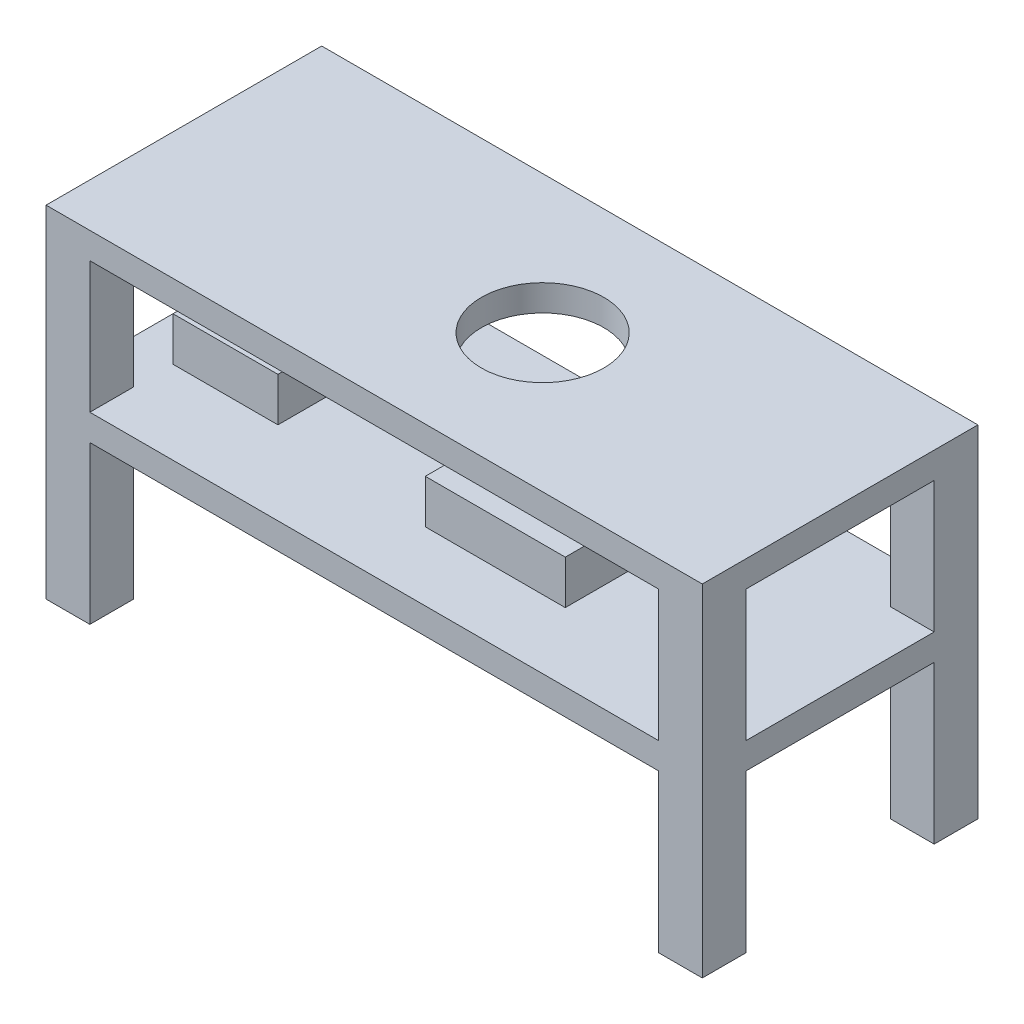
ISO-10303-21;
HEADER;
FILE_DESCRIPTION(('STEP AP214'),'2;1');
FILE_NAME('part.step','',(''),(''),'','','');
FILE_SCHEMA(('AUTOMOTIVE_DESIGN { 1 0 10303 214 1 1 1 1 }'));
ENDSEC;
DATA;
#1=APPLICATION_CONTEXT('core data for automotive mechanical design processes');
#2=APPLICATION_PROTOCOL_DEFINITION('international standard','automotive_design',2000,#1);
#3=PRODUCT_CONTEXT('',#1,'mechanical');
#4=PRODUCT('Part','Part','',(#3));
#5=PRODUCT_RELATED_PRODUCT_CATEGORY('part','',(#4));
#6=PRODUCT_DEFINITION_FORMATION('','',#4);
#7=PRODUCT_DEFINITION_CONTEXT('part definition',#1,'design');
#8=PRODUCT_DEFINITION('design','',#6,#7);
#9=PRODUCT_DEFINITION_SHAPE('','',#8);
#10=(LENGTH_UNIT() NAMED_UNIT(*) SI_UNIT(.MILLI.,.METRE.));
#11=(NAMED_UNIT(*) PLANE_ANGLE_UNIT() SI_UNIT($,.RADIAN.));
#12=(NAMED_UNIT(*) SI_UNIT($,.STERADIAN.) SOLID_ANGLE_UNIT());
#13=UNCERTAINTY_MEASURE_WITH_UNIT(LENGTH_MEASURE(1.E-05),#10,'distance_accuracy_value','');
#14=(GEOMETRIC_REPRESENTATION_CONTEXT(3) GLOBAL_UNCERTAINTY_ASSIGNED_CONTEXT((#13)) GLOBAL_UNIT_ASSIGNED_CONTEXT((#10,
#11,#12)) REPRESENTATION_CONTEXT('',''));
#15=CARTESIAN_POINT('',(0.,0.,0.));
#16=DIRECTION('',(0.,0.,1.));
#17=DIRECTION('',(1.,0.,0.));
#18=AXIS2_PLACEMENT_3D('',#15,#16,#17);
#19=CARTESIAN_POINT('',(0.,-381.,0.));
#20=DIRECTION('',(0.,-1.,0.));
#21=DIRECTION('',(0.,0.,-1.));
#22=AXIS2_PLACEMENT_3D('',#19,#20,#21);
#23=PLANE('',#22);
#24=DIRECTION('',(0.,0.,1.));
#25=VECTOR('',#24,1.);
#26=CARTESIAN_POINT('',(-50.514628547587,-381.,201.224220836117));
#27=LINE('',#26,#25);
#28=CARTESIAN_POINT('',(-50.514628547587,-381.,-205.175779163883));
#29=VERTEX_POINT('',#28);
#30=CARTESIAN_POINT('',(-50.514628547587,-381.,201.224220836117));
#31=VERTEX_POINT('',#30);
#32=EDGE_CURVE('E287',#29,#31,#27,.T.);
#33=ORIENTED_EDGE('',*,*,#32,.F.);
#34=DIRECTION('',(-1.,0.,0.));
#35=VECTOR('',#34,1.);
#36=CARTESIAN_POINT('',(-50.514628547587,-381.,-205.175779163883));
#37=LINE('',#36,#35);
#38=CARTESIAN_POINT('',(355.885371452413,-381.,-205.175779163883));
#39=VERTEX_POINT('',#38);
#40=EDGE_CURVE('E300',#39,#29,#37,.T.);
#41=ORIENTED_EDGE('',*,*,#40,.F.);
#42=DIRECTION('',(0.,0.,-1.));
#43=VECTOR('',#42,1.);
#44=CARTESIAN_POINT('',(355.885371452413,-381.,201.224220836117));
#45=LINE('',#44,#43);
#46=CARTESIAN_POINT('',(355.885371452413,-381.,201.224220836117));
#47=VERTEX_POINT('',#46);
#48=EDGE_CURVE('E309',#47,#39,#45,.T.);
#49=ORIENTED_EDGE('',*,*,#48,.F.);
#50=DIRECTION('',(1.,0.,0.));
#51=VECTOR('',#50,1.);
#52=CARTESIAN_POINT('',(-50.514628547587,-381.,201.224220836117));
#53=LINE('',#52,#51);
#54=EDGE_CURVE('E290',#31,#47,#53,.T.);
#55=ORIENTED_EDGE('',*,*,#54,.F.);
#56=EDGE_LOOP('',(#33,#41,#49,#55));
#57=FACE_BOUND('',#56,.T.);
#58=DIRECTION('',(-1.,0.,0.));
#59=VECTOR('',#58,1.);
#60=CARTESIAN_POINT('',(952.5,-381.,400.05));
#61=LINE('',#60,#59);
#62=CARTESIAN_POINT('',(825.5,-381.,400.05));
#63=VERTEX_POINT('',#62);
#64=CARTESIAN_POINT('',(-825.5,-381.,400.05));
#65=VERTEX_POINT('',#64);
#66=EDGE_CURVE('E443',#63,#65,#61,.T.);
#67=ORIENTED_EDGE('',*,*,#66,.F.);
#68=DIRECTION('',(0.,0.,-1.));
#69=VECTOR('',#68,1.);
#70=CARTESIAN_POINT('',(825.5,-381.,0.));
#71=LINE('',#70,#69);
#72=CARTESIAN_POINT('',(825.5,-381.,273.05));
#73=VERTEX_POINT('',#72);
#74=EDGE_CURVE('E11',#63,#73,#71,.T.);
#75=ORIENTED_EDGE('',*,*,#74,.T.);
#76=DIRECTION('',(1.,0.,0.));
#77=VECTOR('',#76,1.);
#78=CARTESIAN_POINT('',(0.,-381.,273.05));
#79=LINE('',#78,#77);
#80=CARTESIAN_POINT('',(952.5,-381.,273.05));
#81=VERTEX_POINT('',#80);
#82=EDGE_CURVE('E41',#73,#81,#79,.T.);
#83=ORIENTED_EDGE('',*,*,#82,.T.);
#84=DIRECTION('',(0.,0.,1.));
#85=VECTOR('',#84,1.);
#86=CARTESIAN_POINT('',(952.5,-381.,-400.05));
#87=LINE('',#86,#85);
#88=CARTESIAN_POINT('',(952.5,-381.,-273.05));
#89=VERTEX_POINT('',#88);
#90=EDGE_CURVE('E455',#89,#81,#87,.T.);
#91=ORIENTED_EDGE('',*,*,#90,.F.);
#92=DIRECTION('',(-1.,0.,0.));
#93=VECTOR('',#92,1.);
#94=CARTESIAN_POINT('',(0.,-381.,-273.05));
#95=LINE('',#94,#93);
#96=CARTESIAN_POINT('',(825.5,-381.,-273.05));
#97=VERTEX_POINT('',#96);
#98=EDGE_CURVE('E532',#89,#97,#95,.T.);
#99=ORIENTED_EDGE('',*,*,#98,.T.);
#100=DIRECTION('',(0.,0.,-1.));
#101=VECTOR('',#100,1.);
#102=CARTESIAN_POINT('',(825.5,-381.,0.));
#103=LINE('',#102,#101);
#104=CARTESIAN_POINT('',(825.5,-381.,-400.05));
#105=VERTEX_POINT('',#104);
#106=EDGE_CURVE('E529',#97,#105,#103,.T.);
#107=ORIENTED_EDGE('',*,*,#106,.T.);
#108=DIRECTION('',(1.,0.,0.));
#109=VECTOR('',#108,1.);
#110=CARTESIAN_POINT('',(952.5,-381.,-400.05));
#111=LINE('',#110,#109);
#112=CARTESIAN_POINT('',(-825.5,-381.,-400.05));
#113=VERTEX_POINT('',#112);
#114=EDGE_CURVE('E452',#113,#105,#111,.T.);
#115=ORIENTED_EDGE('',*,*,#114,.F.);
#116=DIRECTION('',(0.,0.,1.));
#117=VECTOR('',#116,1.);
#118=CARTESIAN_POINT('',(-825.5,-381.,0.));
#119=LINE('',#118,#117);
#120=CARTESIAN_POINT('',(-825.5,-381.,-273.05));
#121=VERTEX_POINT('',#120);
#122=EDGE_CURVE('E526',#113,#121,#119,.T.);
#123=ORIENTED_EDGE('',*,*,#122,.T.);
#124=DIRECTION('',(-1.,0.,0.));
#125=VECTOR('',#124,1.);
#126=CARTESIAN_POINT('',(0.,-381.,-273.05));
#127=LINE('',#126,#125);
#128=CARTESIAN_POINT('',(-952.5,-381.,-273.05));
#129=VERTEX_POINT('',#128);
#130=EDGE_CURVE('E523',#121,#129,#127,.T.);
#131=ORIENTED_EDGE('',*,*,#130,.T.);
#132=DIRECTION('',(0.,0.,-1.));
#133=VECTOR('',#132,1.);
#134=CARTESIAN_POINT('',(-952.5,-381.,-400.05));
#135=LINE('',#134,#133);
#136=CARTESIAN_POINT('',(-952.5,-381.,273.05));
#137=VERTEX_POINT('',#136);
#138=EDGE_CURVE('E439',#137,#129,#135,.T.);
#139=ORIENTED_EDGE('',*,*,#138,.F.);
#140=DIRECTION('',(-1.,0.,0.));
#141=VECTOR('',#140,1.);
#142=CARTESIAN_POINT('',(-952.5,-381.,273.05));
#143=LINE('',#142,#141);
#144=CARTESIAN_POINT('',(-825.5,-381.,273.05));
#145=VERTEX_POINT('',#144);
#146=EDGE_CURVE('E449',#145,#137,#143,.T.);
#147=ORIENTED_EDGE('',*,*,#146,.F.);
#148=DIRECTION('',(0.,0.,-1.));
#149=VECTOR('',#148,1.);
#150=CARTESIAN_POINT('',(-825.5,-381.,400.05));
#151=LINE('',#150,#149);
#152=EDGE_CURVE('E518',#65,#145,#151,.T.);
#153=ORIENTED_EDGE('',*,*,#152,.F.);
#154=EDGE_LOOP('',(#67,#75,#83,#91,#99,#107,#115,#123,#131,#139,#147,#153));
#155=FACE_BOUND('',#154,.T.);
#156=DIRECTION('',(0.,0.,1.));
#157=VECTOR('',#156,1.);
#158=CARTESIAN_POINT('',(-825.5,-381.,-146.05));
#159=LINE('',#158,#157);
#160=CARTESIAN_POINT('',(-825.5,-381.,-146.05));
#161=VERTEX_POINT('',#160);
#162=CARTESIAN_POINT('',(-825.5,-381.,158.75));
#163=VERTEX_POINT('',#162);
#164=EDGE_CURVE('E286',#161,#163,#159,.T.);
#165=ORIENTED_EDGE('',*,*,#164,.F.);
#166=DIRECTION('',(-1.,0.,0.));
#167=VECTOR('',#166,1.);
#168=CARTESIAN_POINT('',(-825.5,-381.,-146.05));
#169=LINE('',#168,#167);
#170=CARTESIAN_POINT('',(-520.7,-381.,-146.05));
#171=VERTEX_POINT('',#170);
#172=EDGE_CURVE('E283',#171,#161,#169,.T.);
#173=ORIENTED_EDGE('',*,*,#172,.F.);
#174=DIRECTION('',(0.,0.,-1.));
#175=VECTOR('',#174,1.);
#176=CARTESIAN_POINT('',(-520.7,-381.,-146.05));
#177=LINE('',#176,#175);
#178=CARTESIAN_POINT('',(-520.7,-381.,158.75));
#179=VERTEX_POINT('',#178);
#180=EDGE_CURVE('E53',#179,#171,#177,.T.);
#181=ORIENTED_EDGE('',*,*,#180,.F.);
#182=DIRECTION('',(1.,0.,0.));
#183=VECTOR('',#182,1.);
#184=CARTESIAN_POINT('',(-825.5,-381.,158.75));
#185=LINE('',#184,#183);
#186=EDGE_CURVE('E48',#163,#179,#185,.T.);
#187=ORIENTED_EDGE('',*,*,#186,.F.);
#188=EDGE_LOOP('',(#165,#173,#181,#187));
#189=FACE_BOUND('',#188,.T.);
#190=ADVANCED_FACE('F33',(#57,#155,#189),#23,.F.);
#191=CARTESIAN_POINT('',(-952.5,-914.4,273.05));
#192=DIRECTION('',(0.,0.,-1.));
#193=DIRECTION('',(-1.,0.,0.));
#194=AXIS2_PLACEMENT_3D('',#191,#192,#193);
#195=PLANE('',#194);
#196=DIRECTION('',(0.,1.,0.));
#197=VECTOR('',#196,1.);
#198=CARTESIAN_POINT('',(-825.5,-914.4,273.05));
#199=LINE('',#198,#197);
#200=CARTESIAN_POINT('',(-825.5,0.,273.05));
#201=VERTEX_POINT('',#200);
#202=EDGE_CURVE('E484',#145,#201,#199,.T.);
#203=ORIENTED_EDGE('',*,*,#202,.F.);
#204=ORIENTED_EDGE('',*,*,#146,.T.);
#205=DIRECTION('',(0.,1.,0.));
#206=VECTOR('',#205,1.);
#207=CARTESIAN_POINT('',(-952.5,-914.4,273.05));
#208=LINE('',#207,#206);
#209=CARTESIAN_POINT('',(-952.5,0.,273.05));
#210=VERTEX_POINT('',#209);
#211=EDGE_CURVE('E480',#137,#210,#208,.T.);
#212=ORIENTED_EDGE('',*,*,#211,.T.);
#213=DIRECTION('',(-1.,0.,0.));
#214=VECTOR('',#213,1.);
#215=CARTESIAN_POINT('',(0.,0.,273.05));
#216=LINE('',#215,#214);
#217=EDGE_CURVE('E515',#201,#210,#216,.T.);
#218=ORIENTED_EDGE('',*,*,#217,.F.);
#219=EDGE_LOOP('',(#203,#204,#212,#218));
#220=FACE_BOUND('',#219,.T.);
#221=ADVANCED_FACE('F578',(#220),#195,.T.);
#222=CARTESIAN_POINT('',(-825.5,-914.4,400.05));
#223=DIRECTION('',(1.,0.,0.));
#224=DIRECTION('',(0.,0.,-1.));
#225=AXIS2_PLACEMENT_3D('',#222,#223,#224);
#226=PLANE('',#225);
#227=DIRECTION('',(0.,1.,0.));
#228=VECTOR('',#227,1.);
#229=CARTESIAN_POINT('',(-825.5,-914.4,400.05));
#230=LINE('',#229,#228);
#231=CARTESIAN_POINT('',(-825.5,0.,400.05));
#232=VERTEX_POINT('',#231);
#233=EDGE_CURVE('E475',#65,#232,#230,.T.);
#234=ORIENTED_EDGE('',*,*,#233,.F.);
#235=ORIENTED_EDGE('',*,*,#152,.T.);
#236=ORIENTED_EDGE('',*,*,#202,.T.);
#237=DIRECTION('',(0.,0.,-1.));
#238=VECTOR('',#237,1.);
#239=CARTESIAN_POINT('',(-825.5,0.,0.));
#240=LINE('',#239,#238);
#241=EDGE_CURVE('E512',#232,#201,#240,.T.);
#242=ORIENTED_EDGE('',*,*,#241,.F.);
#243=EDGE_LOOP('',(#234,#235,#236,#242));
#244=FACE_BOUND('',#243,.T.);
#245=ADVANCED_FACE('F583',(#244),#226,.T.);
#246=CARTESIAN_POINT('',(-952.5,76.2,400.05));
#247=DIRECTION('',(1.,0.,0.));
#248=DIRECTION('',(0.,0.,-1.));
#249=AXIS2_PLACEMENT_3D('',#246,#247,#248);
#250=PLANE('',#249);
#251=DIRECTION('',(0.,1.,0.));
#252=VECTOR('',#251,1.);
#253=CARTESIAN_POINT('',(-952.5,-914.4,-273.05));
#254=LINE('',#253,#252);
#255=CARTESIAN_POINT('',(-952.5,0.,-273.05));
#256=VERTEX_POINT('',#255);
#257=EDGE_CURVE('E415',#129,#256,#254,.T.);
#258=ORIENTED_EDGE('',*,*,#257,.T.);
#259=DIRECTION('',(0.,0.,1.));
#260=VECTOR('',#259,1.);
#261=CARTESIAN_POINT('',(-952.5,0.,400.05));
#262=LINE('',#261,#260);
#263=EDGE_CURVE('E479',#256,#210,#262,.T.);
#264=ORIENTED_EDGE('',*,*,#263,.T.);
#265=ORIENTED_EDGE('',*,*,#211,.F.);
#266=ORIENTED_EDGE('',*,*,#138,.T.);
#267=EDGE_LOOP('',(#258,#264,#265,#266));
#268=FACE_BOUND('',#267,.T.);
#269=DIRECTION('',(0.,-1.,0.));
#270=VECTOR('',#269,1.);
#271=CARTESIAN_POINT('',(-952.5,76.2,400.05));
#272=LINE('',#271,#270);
#273=CARTESIAN_POINT('',(-952.5,76.2,400.05));
#274=VERTEX_POINT('',#273);
#275=CARTESIAN_POINT('',(-952.5,-914.4,400.05));
#276=VERTEX_POINT('',#275);
#277=EDGE_CURVE('E510',#274,#276,#272,.T.);
#278=ORIENTED_EDGE('',*,*,#277,.F.);
#279=DIRECTION('',(0.,0.,1.));
#280=VECTOR('',#279,1.);
#281=CARTESIAN_POINT('',(-952.5,76.2,400.05));
#282=LINE('',#281,#280);
#283=CARTESIAN_POINT('',(-952.5,76.2,-400.05));
#284=VERTEX_POINT('',#283);
#285=EDGE_CURVE('E488',#284,#274,#282,.T.);
#286=ORIENTED_EDGE('',*,*,#285,.F.);
#287=DIRECTION('',(0.,-1.,0.));
#288=VECTOR('',#287,1.);
#289=CARTESIAN_POINT('',(-952.5,76.2,-400.05));
#290=LINE('',#289,#288);
#291=CARTESIAN_POINT('',(-952.5,-914.4,-400.05));
#292=VERTEX_POINT('',#291);
#293=EDGE_CURVE('E497',#284,#292,#290,.T.);
#294=ORIENTED_EDGE('',*,*,#293,.T.);
#295=DIRECTION('',(0.,0.,1.));
#296=VECTOR('',#295,1.);
#297=CARTESIAN_POINT('',(-952.5,-914.4,-400.05));
#298=LINE('',#297,#296);
#299=CARTESIAN_POINT('',(-952.5,-914.4,-273.05));
#300=VERTEX_POINT('',#299);
#301=EDGE_CURVE('E403',#292,#300,#298,.T.);
#302=ORIENTED_EDGE('',*,*,#301,.T.);
#303=CARTESIAN_POINT('',(-952.5,-457.2,-273.05));
#304=VERTEX_POINT('',#303);
#305=EDGE_CURVE('E425',#300,#304,#254,.T.);
#306=ORIENTED_EDGE('',*,*,#305,.T.);
#307=DIRECTION('',(0.,0.,-1.));
#308=VECTOR('',#307,1.);
#309=CARTESIAN_POINT('',(-952.5,-457.2,-400.05));
#310=LINE('',#309,#308);
#311=CARTESIAN_POINT('',(-952.5,-457.2,273.05));
#312=VERTEX_POINT('',#311);
#313=EDGE_CURVE('E440',#312,#304,#310,.T.);
#314=ORIENTED_EDGE('',*,*,#313,.F.);
#315=CARTESIAN_POINT('',(-952.5,-914.4,273.05));
#316=VERTEX_POINT('',#315);
#317=EDGE_CURVE('E476',#316,#312,#208,.T.);
#318=ORIENTED_EDGE('',*,*,#317,.F.);
#319=DIRECTION('',(0.,0.,1.));
#320=VECTOR('',#319,1.);
#321=CARTESIAN_POINT('',(-952.5,-914.4,400.05));
#322=LINE('',#321,#320);
#323=EDGE_CURVE('E463',#316,#276,#322,.T.);
#324=ORIENTED_EDGE('',*,*,#323,.T.);
#325=EDGE_LOOP('',(#278,#286,#294,#302,#306,#314,#318,#324));
#326=FACE_BOUND('',#325,.T.);
#327=ADVANCED_FACE('F35',(#268,#326),#250,.F.);
#328=CARTESIAN_POINT('',(952.5,76.2,400.05));
#329=DIRECTION('',(0.,0.,-1.));
#330=DIRECTION('',(-1.,0.,0.));
#331=AXIS2_PLACEMENT_3D('',#328,#329,#330);
#332=PLANE('',#331);
#333=DIRECTION('',(0.,1.,0.));
#334=VECTOR('',#333,1.);
#335=CARTESIAN_POINT('',(825.5,-914.4,400.05));
#336=LINE('',#335,#334);
#337=CARTESIAN_POINT('',(825.5,0.,400.05));
#338=VERTEX_POINT('',#337);
#339=EDGE_CURVE('E348',#63,#338,#336,.T.);
#340=ORIENTED_EDGE('',*,*,#339,.F.);
#341=ORIENTED_EDGE('',*,*,#66,.T.);
#342=ORIENTED_EDGE('',*,*,#233,.T.);
#343=DIRECTION('',(1.,0.,0.));
#344=VECTOR('',#343,1.);
#345=CARTESIAN_POINT('',(952.5,0.,400.05));
#346=LINE('',#345,#344);
#347=EDGE_CURVE('E499',#232,#338,#346,.T.);
#348=ORIENTED_EDGE('',*,*,#347,.T.);
#349=EDGE_LOOP('',(#340,#341,#342,#348));
#350=FACE_BOUND('',#349,.T.);
#351=DIRECTION('',(-1.,0.,0.));
#352=VECTOR('',#351,1.);
#353=CARTESIAN_POINT('',(952.5,-457.2,400.05));
#354=LINE('',#353,#352);
#355=CARTESIAN_POINT('',(825.5,-457.2,400.05));
#356=VERTEX_POINT('',#355);
#357=CARTESIAN_POINT('',(-825.5,-457.2,400.05));
#358=VERTEX_POINT('',#357);
#359=EDGE_CURVE('E447',#356,#358,#354,.T.);
#360=ORIENTED_EDGE('',*,*,#359,.F.);
#361=CARTESIAN_POINT('',(825.5,-914.4,400.05));
#362=VERTEX_POINT('',#361);
#363=EDGE_CURVE('E344',#362,#356,#336,.T.);
#364=ORIENTED_EDGE('',*,*,#363,.F.);
#365=DIRECTION('',(1.,0.,0.));
#366=VECTOR('',#365,1.);
#367=CARTESIAN_POINT('',(952.5,-914.4,400.05));
#368=LINE('',#367,#366);
#369=CARTESIAN_POINT('',(952.5,-914.4,400.05));
#370=VERTEX_POINT('',#369);
#371=EDGE_CURVE('E340',#362,#370,#368,.T.);
#372=ORIENTED_EDGE('',*,*,#371,.T.);
#373=DIRECTION('',(0.,-1.,0.));
#374=VECTOR('',#373,1.);
#375=CARTESIAN_POINT('',(952.5,76.2,400.05));
#376=LINE('',#375,#374);
#377=CARTESIAN_POINT('',(952.5,76.2,400.05));
#378=VERTEX_POINT('',#377);
#379=EDGE_CURVE('E508',#378,#370,#376,.T.);
#380=ORIENTED_EDGE('',*,*,#379,.F.);
#381=DIRECTION('',(1.,0.,0.));
#382=VECTOR('',#381,1.);
#383=CARTESIAN_POINT('',(952.5,76.2,400.05));
#384=LINE('',#383,#382);
#385=EDGE_CURVE('E490',#274,#378,#384,.T.);
#386=ORIENTED_EDGE('',*,*,#385,.F.);
#387=ORIENTED_EDGE('',*,*,#277,.T.);
#388=DIRECTION('',(1.,0.,0.));
#389=VECTOR('',#388,1.);
#390=CARTESIAN_POINT('',(-952.5,-914.4,400.05));
#391=LINE('',#390,#389);
#392=CARTESIAN_POINT('',(-825.5,-914.4,400.05));
#393=VERTEX_POINT('',#392);
#394=EDGE_CURVE('E466',#276,#393,#391,.T.);
#395=ORIENTED_EDGE('',*,*,#394,.T.);
#396=EDGE_CURVE('E485',#393,#358,#230,.T.);
#397=ORIENTED_EDGE('',*,*,#396,.T.);
#398=EDGE_LOOP('',(#360,#364,#372,#380,#386,#387,#395,#397));
#399=FACE_BOUND('',#398,.T.);
#400=ADVANCED_FACE('F587',(#350,#399),#332,.F.);
#401=CARTESIAN_POINT('',(952.5,76.2,400.05));
#402=DIRECTION('',(-1.,0.,0.));
#403=DIRECTION('',(0.,0.,1.));
#404=AXIS2_PLACEMENT_3D('',#401,#402,#403);
#405=PLANE('',#404);
#406=DIRECTION('',(0.,1.,0.));
#407=VECTOR('',#406,1.);
#408=CARTESIAN_POINT('',(952.5,-914.4,273.05));
#409=LINE('',#408,#407);
#410=CARTESIAN_POINT('',(952.5,0.,273.05));
#411=VERTEX_POINT('',#410);
#412=EDGE_CURVE('E343',#81,#411,#409,.T.);
#413=ORIENTED_EDGE('',*,*,#412,.T.);
#414=DIRECTION('',(0.,0.,-1.));
#415=VECTOR('',#414,1.);
#416=CARTESIAN_POINT('',(952.5,0.,400.05));
#417=LINE('',#416,#415);
#418=CARTESIAN_POINT('',(952.5,0.,-273.05));
#419=VERTEX_POINT('',#418);
#420=EDGE_CURVE('E502',#411,#419,#417,.T.);
#421=ORIENTED_EDGE('',*,*,#420,.T.);
#422=DIRECTION('',(0.,1.,0.));
#423=VECTOR('',#422,1.);
#424=CARTESIAN_POINT('',(952.5,-914.4,-273.05));
#425=LINE('',#424,#423);
#426=EDGE_CURVE('E384',#89,#419,#425,.T.);
#427=ORIENTED_EDGE('',*,*,#426,.F.);
#428=ORIENTED_EDGE('',*,*,#90,.T.);
#429=EDGE_LOOP('',(#413,#421,#427,#428));
#430=FACE_BOUND('',#429,.T.);
#431=DIRECTION('',(0.,-1.,0.));
#432=VECTOR('',#431,1.);
#433=CARTESIAN_POINT('',(952.5,76.2,-400.05));
#434=LINE('',#433,#432);
#435=CARTESIAN_POINT('',(952.5,76.2,-400.05));
#436=VERTEX_POINT('',#435);
#437=CARTESIAN_POINT('',(952.5,-914.4,-400.05));
#438=VERTEX_POINT('',#437);
#439=EDGE_CURVE('E506',#436,#438,#434,.T.);
#440=ORIENTED_EDGE('',*,*,#439,.F.);
#441=DIRECTION('',(0.,0.,-1.));
#442=VECTOR('',#441,1.);
#443=CARTESIAN_POINT('',(952.5,76.2,400.05));
#444=LINE('',#443,#442);
#445=EDGE_CURVE('E493',#378,#436,#444,.T.);
#446=ORIENTED_EDGE('',*,*,#445,.F.);
#447=ORIENTED_EDGE('',*,*,#379,.T.);
#448=DIRECTION('',(0.,0.,-1.));
#449=VECTOR('',#448,1.);
#450=CARTESIAN_POINT('',(952.5,-914.4,400.05));
#451=LINE('',#450,#449);
#452=CARTESIAN_POINT('',(952.5,-914.4,273.05));
#453=VERTEX_POINT('',#452);
#454=EDGE_CURVE('E329',#370,#453,#451,.T.);
#455=ORIENTED_EDGE('',*,*,#454,.T.);
#456=CARTESIAN_POINT('',(952.5,-457.2,273.05));
#457=VERTEX_POINT('',#456);
#458=EDGE_CURVE('E353',#453,#457,#409,.T.);
#459=ORIENTED_EDGE('',*,*,#458,.T.);
#460=DIRECTION('',(0.,0.,1.));
#461=VECTOR('',#460,1.);
#462=CARTESIAN_POINT('',(952.5,-457.2,-400.05));
#463=LINE('',#462,#461);
#464=CARTESIAN_POINT('',(952.5,-457.2,-273.05));
#465=VERTEX_POINT('',#464);
#466=EDGE_CURVE('E445',#465,#457,#463,.T.);
#467=ORIENTED_EDGE('',*,*,#466,.F.);
#468=CARTESIAN_POINT('',(952.5,-914.4,-273.05));
#469=VERTEX_POINT('',#468);
#470=EDGE_CURVE('E380',#469,#465,#425,.T.);
#471=ORIENTED_EDGE('',*,*,#470,.F.);
#472=DIRECTION('',(0.,0.,-1.));
#473=VECTOR('',#472,1.);
#474=CARTESIAN_POINT('',(952.5,-914.4,-400.05));
#475=LINE('',#474,#473);
#476=EDGE_CURVE('E367',#469,#438,#475,.T.);
#477=ORIENTED_EDGE('',*,*,#476,.T.);
#478=EDGE_LOOP('',(#440,#446,#447,#455,#459,#467,#471,#477));
#479=FACE_BOUND('',#478,.T.);
#480=ADVANCED_FACE('F543',(#430,#479),#405,.F.);
#481=CARTESIAN_POINT('',(952.5,76.2,-400.05));
#482=DIRECTION('',(0.,0.,1.));
#483=DIRECTION('',(1.,0.,0.));
#484=AXIS2_PLACEMENT_3D('',#481,#482,#483);
#485=PLANE('',#484);
#486=DIRECTION('',(0.,1.,0.));
#487=VECTOR('',#486,1.);
#488=CARTESIAN_POINT('',(825.5,-914.4,-400.05));
#489=LINE('',#488,#487);
#490=CARTESIAN_POINT('',(825.5,0.,-400.05));
#491=VERTEX_POINT('',#490);
#492=EDGE_CURVE('E379',#105,#491,#489,.T.);
#493=ORIENTED_EDGE('',*,*,#492,.T.);
#494=DIRECTION('',(-1.,0.,0.));
#495=VECTOR('',#494,1.);
#496=CARTESIAN_POINT('',(952.5,0.,-400.05));
#497=LINE('',#496,#495);
#498=CARTESIAN_POINT('',(-825.5,0.,-400.05));
#499=VERTEX_POINT('',#498);
#500=EDGE_CURVE('E491',#491,#499,#497,.T.);
#501=ORIENTED_EDGE('',*,*,#500,.T.);
#502=DIRECTION('',(0.,1.,0.));
#503=VECTOR('',#502,1.);
#504=CARTESIAN_POINT('',(-825.5,-914.4,-400.05));
#505=LINE('',#504,#503);
#506=EDGE_CURVE('E420',#113,#499,#505,.T.);
#507=ORIENTED_EDGE('',*,*,#506,.F.);
#508=ORIENTED_EDGE('',*,*,#114,.T.);
#509=EDGE_LOOP('',(#493,#501,#507,#508));
#510=FACE_BOUND('',#509,.T.);
#511=ORIENTED_EDGE('',*,*,#293,.F.);
#512=DIRECTION('',(-1.,0.,0.));
#513=VECTOR('',#512,1.);
#514=CARTESIAN_POINT('',(952.5,76.2,-400.05));
#515=LINE('',#514,#513);
#516=EDGE_CURVE('E495',#436,#284,#515,.T.);
#517=ORIENTED_EDGE('',*,*,#516,.F.);
#518=ORIENTED_EDGE('',*,*,#439,.T.);
#519=DIRECTION('',(-1.,0.,0.));
#520=VECTOR('',#519,1.);
#521=CARTESIAN_POINT('',(952.5,-914.4,-400.05));
#522=LINE('',#521,#520);
#523=CARTESIAN_POINT('',(825.5,-914.4,-400.05));
#524=VERTEX_POINT('',#523);
#525=EDGE_CURVE('E370',#438,#524,#522,.T.);
#526=ORIENTED_EDGE('',*,*,#525,.T.);
#527=CARTESIAN_POINT('',(825.5,-457.2,-400.05));
#528=VERTEX_POINT('',#527);
#529=EDGE_CURVE('E389',#524,#528,#489,.T.);
#530=ORIENTED_EDGE('',*,*,#529,.T.);
#531=DIRECTION('',(1.,0.,0.));
#532=VECTOR('',#531,1.);
#533=CARTESIAN_POINT('',(952.5,-457.2,-400.05));
#534=LINE('',#533,#532);
#535=CARTESIAN_POINT('',(-825.5,-457.2,-400.05));
#536=VERTEX_POINT('',#535);
#537=EDGE_CURVE('E442',#536,#528,#534,.T.);
#538=ORIENTED_EDGE('',*,*,#537,.F.);
#539=CARTESIAN_POINT('',(-825.5,-914.4,-400.05));
#540=VERTEX_POINT('',#539);
#541=EDGE_CURVE('E416',#540,#536,#505,.T.);
#542=ORIENTED_EDGE('',*,*,#541,.F.);
#543=DIRECTION('',(-1.,0.,0.));
#544=VECTOR('',#543,1.);
#545=CARTESIAN_POINT('',(-952.5,-914.4,-400.05));
#546=LINE('',#545,#544);
#547=EDGE_CURVE('E412',#540,#292,#546,.T.);
#548=ORIENTED_EDGE('',*,*,#547,.T.);
#549=EDGE_LOOP('',(#511,#517,#518,#526,#530,#538,#542,#548));
#550=FACE_BOUND('',#549,.T.);
#551=ADVANCED_FACE('F560',(#510,#550),#485,.F.);
#552=CARTESIAN_POINT('',(0.,76.2,0.));
#553=DIRECTION('',(0.,1.,0.));
#554=DIRECTION('',(0.,0.,1.));
#555=AXIS2_PLACEMENT_3D('',#552,#553,#554);
#556=PLANE('',#555);
#557=CARTESIAN_POINT('',(88.9000000000002,76.2,0.));
#558=DIRECTION('',(0.,1.,0.));
#559=DIRECTION('',(0.,0.,1.));
#560=AXIS2_PLACEMENT_3D('',#557,#558,#559);
#561=CIRCLE('',#560,177.8);
#562=CARTESIAN_POINT('',(88.9000000000002,76.2,177.8));
#563=VERTEX_POINT('',#562);
#564=EDGE_CURVE('E325',#563,#563,#561,.T.);
#565=ORIENTED_EDGE('',*,*,#564,.F.);
#566=EDGE_LOOP('',(#565));
#567=FACE_BOUND('',#566,.T.);
#568=ORIENTED_EDGE('',*,*,#385,.T.);
#569=ORIENTED_EDGE('',*,*,#445,.T.);
#570=ORIENTED_EDGE('',*,*,#516,.T.);
#571=ORIENTED_EDGE('',*,*,#285,.T.);
#572=EDGE_LOOP('',(#568,#569,#570,#571));
#573=FACE_BOUND('',#572,.T.);
#574=ADVANCED_FACE('F631',(#567,#573),#556,.T.);
#575=CARTESIAN_POINT('',(0.,0.,0.));
#576=DIRECTION('',(0.,1.,0.));
#577=DIRECTION('',(0.,0.,1.));
#578=AXIS2_PLACEMENT_3D('',#575,#576,#577);
#579=PLANE('',#578);
#580=CARTESIAN_POINT('',(88.9000000000002,0.,0.));
#581=DIRECTION('',(0.,1.,0.));
#582=DIRECTION('',(0.,0.,1.));
#583=AXIS2_PLACEMENT_3D('',#580,#581,#582);
#584=CIRCLE('',#583,177.8);
#585=CARTESIAN_POINT('',(88.9000000000002,0.,177.8));
#586=VERTEX_POINT('',#585);
#587=EDGE_CURVE('E326',#586,#586,#584,.T.);
#588=ORIENTED_EDGE('',*,*,#587,.T.);
#589=EDGE_LOOP('',(#588));
#590=FACE_BOUND('',#589,.T.);
#591=DIRECTION('',(-1.,0.,0.));
#592=VECTOR('',#591,1.);
#593=CARTESIAN_POINT('',(0.,0.,273.05));
#594=LINE('',#593,#592);
#595=CARTESIAN_POINT('',(825.5,0.,273.05));
#596=VERTEX_POINT('',#595);
#597=EDGE_CURVE('E358',#411,#596,#594,.T.);
#598=ORIENTED_EDGE('',*,*,#597,.T.);
#599=DIRECTION('',(0.,0.,1.));
#600=VECTOR('',#599,1.);
#601=CARTESIAN_POINT('',(825.5,0.,0.));
#602=LINE('',#601,#600);
#603=EDGE_CURVE('E364',#596,#338,#602,.T.);
#604=ORIENTED_EDGE('',*,*,#603,.T.);
#605=ORIENTED_EDGE('',*,*,#347,.F.);
#606=ORIENTED_EDGE('',*,*,#241,.T.);
#607=ORIENTED_EDGE('',*,*,#217,.T.);
#608=ORIENTED_EDGE('',*,*,#263,.F.);
#609=DIRECTION('',(1.,0.,0.));
#610=VECTOR('',#609,1.);
#611=CARTESIAN_POINT('',(0.,0.,-273.05));
#612=LINE('',#611,#610);
#613=CARTESIAN_POINT('',(-825.5,0.,-273.05));
#614=VERTEX_POINT('',#613);
#615=EDGE_CURVE('E430',#256,#614,#612,.T.);
#616=ORIENTED_EDGE('',*,*,#615,.T.);
#617=DIRECTION('',(0.,0.,-1.));
#618=VECTOR('',#617,1.);
#619=CARTESIAN_POINT('',(-825.5,0.,0.));
#620=LINE('',#619,#618);
#621=EDGE_CURVE('E436',#614,#499,#620,.T.);
#622=ORIENTED_EDGE('',*,*,#621,.T.);
#623=ORIENTED_EDGE('',*,*,#500,.F.);
#624=DIRECTION('',(0.,0.,1.));
#625=VECTOR('',#624,1.);
#626=CARTESIAN_POINT('',(825.5,0.,0.));
#627=LINE('',#626,#625);
#628=CARTESIAN_POINT('',(825.5,0.,-273.05));
#629=VERTEX_POINT('',#628);
#630=EDGE_CURVE('E394',#491,#629,#627,.T.);
#631=ORIENTED_EDGE('',*,*,#630,.T.);
#632=DIRECTION('',(1.,0.,0.));
#633=VECTOR('',#632,1.);
#634=CARTESIAN_POINT('',(0.,0.,-273.05));
#635=LINE('',#634,#633);
#636=EDGE_CURVE('E400',#629,#419,#635,.T.);
#637=ORIENTED_EDGE('',*,*,#636,.T.);
#638=ORIENTED_EDGE('',*,*,#420,.F.);
#639=EDGE_LOOP('',(#598,#604,#605,#606,#607,#608,#616,#622,#623,#631,#637,#638));
#640=FACE_BOUND('',#639,.T.);
#641=ADVANCED_FACE('F552',(#590,#640),#579,.F.);
#642=DIRECTION('',(-1.,0.,0.));
#643=VECTOR('',#642,1.);
#644=CARTESIAN_POINT('',(-952.5,-457.2,273.05));
#645=LINE('',#644,#643);
#646=CARTESIAN_POINT('',(-825.5,-457.2,273.05));
#647=VERTEX_POINT('',#646);
#648=EDGE_CURVE('E461',#647,#312,#645,.T.);
#649=ORIENTED_EDGE('',*,*,#648,.F.);
#650=CARTESIAN_POINT('',(-825.5,-914.4,273.05));
#651=VERTEX_POINT('',#650);
#652=EDGE_CURVE('E481',#651,#647,#199,.T.);
#653=ORIENTED_EDGE('',*,*,#652,.F.);
#654=DIRECTION('',(-1.,0.,0.));
#655=VECTOR('',#654,1.);
#656=CARTESIAN_POINT('',(-952.5,-914.4,273.05));
#657=LINE('',#656,#655);
#658=EDGE_CURVE('E472',#651,#316,#657,.T.);
#659=ORIENTED_EDGE('',*,*,#658,.T.);
#660=ORIENTED_EDGE('',*,*,#317,.T.);
#661=EDGE_LOOP('',(#649,#653,#659,#660));
#662=FACE_BOUND('',#661,.T.);
#663=ADVANCED_FACE('F616',(#662),#195,.T.);
#664=DIRECTION('',(0.,0.,-1.));
#665=VECTOR('',#664,1.);
#666=CARTESIAN_POINT('',(-825.5,-457.2,400.05));
#667=LINE('',#666,#665);
#668=EDGE_CURVE('E521',#358,#647,#667,.T.);
#669=ORIENTED_EDGE('',*,*,#668,.F.);
#670=ORIENTED_EDGE('',*,*,#396,.F.);
#671=DIRECTION('',(0.,0.,-1.));
#672=VECTOR('',#671,1.);
#673=CARTESIAN_POINT('',(-825.5,-914.4,400.05));
#674=LINE('',#673,#672);
#675=EDGE_CURVE('E469',#393,#651,#674,.T.);
#676=ORIENTED_EDGE('',*,*,#675,.T.);
#677=ORIENTED_EDGE('',*,*,#652,.T.);
#678=EDGE_LOOP('',(#669,#670,#676,#677));
#679=FACE_BOUND('',#678,.T.);
#680=ADVANCED_FACE('F623',(#679),#226,.T.);
#681=CARTESIAN_POINT('',(0.,-914.4,0.));
#682=DIRECTION('',(0.,-1.,0.));
#683=DIRECTION('',(0.,0.,-1.));
#684=AXIS2_PLACEMENT_3D('',#681,#682,#683);
#685=PLANE('',#684);
#686=ORIENTED_EDGE('',*,*,#323,.F.);
#687=ORIENTED_EDGE('',*,*,#658,.F.);
#688=ORIENTED_EDGE('',*,*,#675,.F.);
#689=ORIENTED_EDGE('',*,*,#394,.F.);
#690=EDGE_LOOP('',(#686,#687,#688,#689));
#691=FACE_BOUND('',#690,.T.);
#692=ADVANCED_FACE('F621',(#691),#685,.T.);
#693=CARTESIAN_POINT('',(0.,-457.2,0.));
#694=DIRECTION('',(0.,-1.,0.));
#695=DIRECTION('',(0.,0.,-1.));
#696=AXIS2_PLACEMENT_3D('',#693,#694,#695);
#697=PLANE('',#696);
#698=DIRECTION('',(0.,0.,-1.));
#699=VECTOR('',#698,1.);
#700=CARTESIAN_POINT('',(825.5,-457.2,0.));
#701=LINE('',#700,#699);
#702=CARTESIAN_POINT('',(825.5,-457.2,273.05));
#703=VERTEX_POINT('',#702);
#704=EDGE_CURVE('E361',#356,#703,#701,.T.);
#705=ORIENTED_EDGE('',*,*,#704,.F.);
#706=ORIENTED_EDGE('',*,*,#359,.T.);
#707=ORIENTED_EDGE('',*,*,#668,.T.);
#708=ORIENTED_EDGE('',*,*,#648,.T.);
#709=ORIENTED_EDGE('',*,*,#313,.T.);
#710=DIRECTION('',(-1.,0.,0.));
#711=VECTOR('',#710,1.);
#712=CARTESIAN_POINT('',(0.,-457.2,-273.05));
#713=LINE('',#712,#711);
#714=CARTESIAN_POINT('',(-825.5,-457.2,-273.05));
#715=VERTEX_POINT('',#714);
#716=EDGE_CURVE('E419',#715,#304,#713,.T.);
#717=ORIENTED_EDGE('',*,*,#716,.F.);
#718=DIRECTION('',(0.,0.,1.));
#719=VECTOR('',#718,1.);
#720=CARTESIAN_POINT('',(-825.5,-457.2,0.));
#721=LINE('',#720,#719);
#722=EDGE_CURVE('E433',#536,#715,#721,.T.);
#723=ORIENTED_EDGE('',*,*,#722,.F.);
#724=ORIENTED_EDGE('',*,*,#537,.T.);
#725=DIRECTION('',(0.,0.,-1.));
#726=VECTOR('',#725,1.);
#727=CARTESIAN_POINT('',(825.5,-457.2,0.));
#728=LINE('',#727,#726);
#729=CARTESIAN_POINT('',(825.5,-457.2,-273.05));
#730=VERTEX_POINT('',#729);
#731=EDGE_CURVE('E383',#730,#528,#728,.T.);
#732=ORIENTED_EDGE('',*,*,#731,.F.);
#733=DIRECTION('',(-1.,0.,0.));
#734=VECTOR('',#733,1.);
#735=CARTESIAN_POINT('',(0.,-457.2,-273.05));
#736=LINE('',#735,#734);
#737=EDGE_CURVE('E397',#465,#730,#736,.T.);
#738=ORIENTED_EDGE('',*,*,#737,.F.);
#739=ORIENTED_EDGE('',*,*,#466,.T.);
#740=DIRECTION('',(1.,0.,0.));
#741=VECTOR('',#740,1.);
#742=CARTESIAN_POINT('',(0.,-457.2,273.05));
#743=LINE('',#742,#741);
#744=EDGE_CURVE('E347',#703,#457,#743,.T.);
#745=ORIENTED_EDGE('',*,*,#744,.F.);
#746=EDGE_LOOP('',(#705,#706,#707,#708,#709,#717,#723,#724,#732,#738,#739,#745));
#747=FACE_BOUND('',#746,.T.);
#748=ADVANCED_FACE('F619',(#747),#697,.T.);
#749=CARTESIAN_POINT('',(-952.5,-914.4,-273.05));
#750=DIRECTION('',(0.,0.,1.));
#751=DIRECTION('',(1.,0.,0.));
#752=AXIS2_PLACEMENT_3D('',#749,#750,#751);
#753=PLANE('',#752);
#754=ORIENTED_EDGE('',*,*,#615,.F.);
#755=ORIENTED_EDGE('',*,*,#257,.F.);
#756=ORIENTED_EDGE('',*,*,#130,.F.);
#757=DIRECTION('',(0.,1.,0.));
#758=VECTOR('',#757,1.);
#759=CARTESIAN_POINT('',(-825.5,-914.4,-273.05));
#760=LINE('',#759,#758);
#761=EDGE_CURVE('E424',#121,#614,#760,.T.);
#762=ORIENTED_EDGE('',*,*,#761,.T.);
#763=EDGE_LOOP('',(#754,#755,#756,#762));
#764=FACE_BOUND('',#763,.T.);
#765=ADVANCED_FACE('F570',(#764),#753,.T.);
#766=CARTESIAN_POINT('',(-825.5,-914.4,-400.05));
#767=DIRECTION('',(1.,0.,0.));
#768=DIRECTION('',(0.,0.,-1.));
#769=AXIS2_PLACEMENT_3D('',#766,#767,#768);
#770=PLANE('',#769);
#771=ORIENTED_EDGE('',*,*,#621,.F.);
#772=ORIENTED_EDGE('',*,*,#761,.F.);
#773=ORIENTED_EDGE('',*,*,#122,.F.);
#774=ORIENTED_EDGE('',*,*,#506,.T.);
#775=EDGE_LOOP('',(#771,#772,#773,#774));
#776=FACE_BOUND('',#775,.T.);
#777=ADVANCED_FACE('F565',(#776),#770,.T.);
#778=ORIENTED_EDGE('',*,*,#541,.T.);
#779=ORIENTED_EDGE('',*,*,#722,.T.);
#780=CARTESIAN_POINT('',(-825.5,-914.4,-273.05));
#781=VERTEX_POINT('',#780);
#782=EDGE_CURVE('E421',#781,#715,#760,.T.);
#783=ORIENTED_EDGE('',*,*,#782,.F.);
#784=DIRECTION('',(0.,0.,-1.));
#785=VECTOR('',#784,1.);
#786=CARTESIAN_POINT('',(-825.5,-914.4,-400.05));
#787=LINE('',#786,#785);
#788=EDGE_CURVE('E409',#781,#540,#787,.T.);
#789=ORIENTED_EDGE('',*,*,#788,.T.);
#790=EDGE_LOOP('',(#778,#779,#783,#789));
#791=FACE_BOUND('',#790,.T.);
#792=ADVANCED_FACE('F736',(#791),#770,.T.);
#793=ORIENTED_EDGE('',*,*,#782,.T.);
#794=ORIENTED_EDGE('',*,*,#716,.T.);
#795=ORIENTED_EDGE('',*,*,#305,.F.);
#796=DIRECTION('',(1.,0.,0.));
#797=VECTOR('',#796,1.);
#798=CARTESIAN_POINT('',(-952.5,-914.4,-273.05));
#799=LINE('',#798,#797);
#800=EDGE_CURVE('E406',#300,#781,#799,.T.);
#801=ORIENTED_EDGE('',*,*,#800,.T.);
#802=EDGE_LOOP('',(#793,#794,#795,#801));
#803=FACE_BOUND('',#802,.T.);
#804=ADVANCED_FACE('F729',(#803),#753,.T.);
#805=CARTESIAN_POINT('',(0.,-914.4,0.));
#806=DIRECTION('',(0.,1.,0.));
#807=DIRECTION('',(0.,0.,1.));
#808=AXIS2_PLACEMENT_3D('',#805,#806,#807);
#809=PLANE('',#808);
#810=ORIENTED_EDGE('',*,*,#301,.F.);
#811=ORIENTED_EDGE('',*,*,#547,.F.);
#812=ORIENTED_EDGE('',*,*,#788,.F.);
#813=ORIENTED_EDGE('',*,*,#800,.F.);
#814=EDGE_LOOP('',(#810,#811,#812,#813));
#815=FACE_BOUND('',#814,.T.);
#816=ADVANCED_FACE('F751',(#815),#809,.F.);
#817=CARTESIAN_POINT('',(825.5,-914.4,-400.05));
#818=DIRECTION('',(-1.,0.,0.));
#819=DIRECTION('',(0.,0.,1.));
#820=AXIS2_PLACEMENT_3D('',#817,#818,#819);
#821=PLANE('',#820);
#822=ORIENTED_EDGE('',*,*,#630,.F.);
#823=ORIENTED_EDGE('',*,*,#492,.F.);
#824=ORIENTED_EDGE('',*,*,#106,.F.);
#825=DIRECTION('',(0.,1.,0.));
#826=VECTOR('',#825,1.);
#827=CARTESIAN_POINT('',(825.5,-914.4,-273.05));
#828=LINE('',#827,#826);
#829=EDGE_CURVE('E388',#97,#629,#828,.T.);
#830=ORIENTED_EDGE('',*,*,#829,.T.);
#831=EDGE_LOOP('',(#822,#823,#824,#830));
#832=FACE_BOUND('',#831,.T.);
#833=ADVANCED_FACE('F556',(#832),#821,.T.);
#834=CARTESIAN_POINT('',(952.5,-914.4,-273.05));
#835=DIRECTION('',(0.,0.,1.));
#836=DIRECTION('',(1.,0.,0.));
#837=AXIS2_PLACEMENT_3D('',#834,#835,#836);
#838=PLANE('',#837);
#839=ORIENTED_EDGE('',*,*,#636,.F.);
#840=ORIENTED_EDGE('',*,*,#829,.F.);
#841=ORIENTED_EDGE('',*,*,#98,.F.);
#842=ORIENTED_EDGE('',*,*,#426,.T.);
#843=EDGE_LOOP('',(#839,#840,#841,#842));
#844=FACE_BOUND('',#843,.T.);
#845=ADVANCED_FACE('F548',(#844),#838,.T.);
#846=ORIENTED_EDGE('',*,*,#470,.T.);
#847=ORIENTED_EDGE('',*,*,#737,.T.);
#848=CARTESIAN_POINT('',(825.5,-914.4,-273.05));
#849=VERTEX_POINT('',#848);
#850=EDGE_CURVE('E385',#849,#730,#828,.T.);
#851=ORIENTED_EDGE('',*,*,#850,.F.);
#852=DIRECTION('',(1.,0.,0.));
#853=VECTOR('',#852,1.);
#854=CARTESIAN_POINT('',(952.5,-914.4,-273.05));
#855=LINE('',#854,#853);
#856=EDGE_CURVE('E376',#849,#469,#855,.T.);
#857=ORIENTED_EDGE('',*,*,#856,.T.);
#858=EDGE_LOOP('',(#846,#847,#851,#857));
#859=FACE_BOUND('',#858,.T.);
#860=ADVANCED_FACE('F774',(#859),#838,.T.);
#861=ORIENTED_EDGE('',*,*,#850,.T.);
#862=ORIENTED_EDGE('',*,*,#731,.T.);
#863=ORIENTED_EDGE('',*,*,#529,.F.);
#864=DIRECTION('',(0.,0.,1.));
#865=VECTOR('',#864,1.);
#866=CARTESIAN_POINT('',(825.5,-914.4,-400.05));
#867=LINE('',#866,#865);
#868=EDGE_CURVE('E373',#524,#849,#867,.T.);
#869=ORIENTED_EDGE('',*,*,#868,.T.);
#870=EDGE_LOOP('',(#861,#862,#863,#869));
#871=FACE_BOUND('',#870,.T.);
#872=ADVANCED_FACE('F603',(#871),#821,.T.);
#873=CARTESIAN_POINT('',(0.,-914.4,0.));
#874=DIRECTION('',(0.,-1.,0.));
#875=DIRECTION('',(0.,0.,-1.));
#876=AXIS2_PLACEMENT_3D('',#873,#874,#875);
#877=PLANE('',#876);
#878=ORIENTED_EDGE('',*,*,#476,.F.);
#879=ORIENTED_EDGE('',*,*,#856,.F.);
#880=ORIENTED_EDGE('',*,*,#868,.F.);
#881=ORIENTED_EDGE('',*,*,#525,.F.);
#882=EDGE_LOOP('',(#878,#879,#880,#881));
#883=FACE_BOUND('',#882,.T.);
#884=ADVANCED_FACE('F594',(#883),#877,.T.);
#885=CARTESIAN_POINT('',(952.5,-914.4,273.05));
#886=DIRECTION('',(0.,0.,-1.));
#887=DIRECTION('',(-1.,0.,0.));
#888=AXIS2_PLACEMENT_3D('',#885,#886,#887);
#889=PLANE('',#888);
#890=ORIENTED_EDGE('',*,*,#597,.F.);
#891=ORIENTED_EDGE('',*,*,#412,.F.);
#892=ORIENTED_EDGE('',*,*,#82,.F.);
#893=DIRECTION('',(0.,1.,0.));
#894=VECTOR('',#893,1.);
#895=CARTESIAN_POINT('',(825.5,-914.4,273.05));
#896=LINE('',#895,#894);
#897=EDGE_CURVE('E352',#73,#596,#896,.T.);
#898=ORIENTED_EDGE('',*,*,#897,.T.);
#899=EDGE_LOOP('',(#890,#891,#892,#898));
#900=FACE_BOUND('',#899,.T.);
#901=ADVANCED_FACE('F592',(#900),#889,.T.);
#902=CARTESIAN_POINT('',(825.5,-914.4,400.05));
#903=DIRECTION('',(-1.,0.,0.));
#904=DIRECTION('',(0.,0.,1.));
#905=AXIS2_PLACEMENT_3D('',#902,#903,#904);
#906=PLANE('',#905);
#907=ORIENTED_EDGE('',*,*,#603,.F.);
#908=ORIENTED_EDGE('',*,*,#897,.F.);
#909=ORIENTED_EDGE('',*,*,#74,.F.);
#910=ORIENTED_EDGE('',*,*,#339,.T.);
#911=EDGE_LOOP('',(#907,#908,#909,#910));
#912=FACE_BOUND('',#911,.T.);
#913=ADVANCED_FACE('F591',(#912),#906,.T.);
#914=ORIENTED_EDGE('',*,*,#363,.T.);
#915=ORIENTED_EDGE('',*,*,#704,.T.);
#916=CARTESIAN_POINT('',(825.5,-914.4,273.05));
#917=VERTEX_POINT('',#916);
#918=EDGE_CURVE('E349',#917,#703,#896,.T.);
#919=ORIENTED_EDGE('',*,*,#918,.F.);
#920=DIRECTION('',(0.,0.,1.));
#921=VECTOR('',#920,1.);
#922=CARTESIAN_POINT('',(825.5,-914.4,400.05));
#923=LINE('',#922,#921);
#924=EDGE_CURVE('E337',#917,#362,#923,.T.);
#925=ORIENTED_EDGE('',*,*,#924,.T.);
#926=EDGE_LOOP('',(#914,#915,#919,#925));
#927=FACE_BOUND('',#926,.T.);
#928=ADVANCED_FACE('F601',(#927),#906,.T.);
#929=ORIENTED_EDGE('',*,*,#918,.T.);
#930=ORIENTED_EDGE('',*,*,#744,.T.);
#931=ORIENTED_EDGE('',*,*,#458,.F.);
#932=DIRECTION('',(-1.,0.,0.));
#933=VECTOR('',#932,1.);
#934=CARTESIAN_POINT('',(952.5,-914.4,273.05));
#935=LINE('',#934,#933);
#936=EDGE_CURVE('E334',#453,#917,#935,.T.);
#937=ORIENTED_EDGE('',*,*,#936,.T.);
#938=EDGE_LOOP('',(#929,#930,#931,#937));
#939=FACE_BOUND('',#938,.T.);
#940=ADVANCED_FACE('F596',(#939),#889,.T.);
#941=CARTESIAN_POINT('',(0.,-914.4,0.));
#942=DIRECTION('',(0.,1.,0.));
#943=DIRECTION('',(0.,0.,1.));
#944=AXIS2_PLACEMENT_3D('',#941,#942,#943);
#945=PLANE('',#944);
#946=ORIENTED_EDGE('',*,*,#454,.F.);
#947=ORIENTED_EDGE('',*,*,#371,.F.);
#948=ORIENTED_EDGE('',*,*,#924,.F.);
#949=ORIENTED_EDGE('',*,*,#936,.F.);
#950=EDGE_LOOP('',(#946,#947,#948,#949));
#951=FACE_BOUND('',#950,.T.);
#952=ADVANCED_FACE('F607',(#951),#945,.F.);
#953=CARTESIAN_POINT('',(88.9000000000002,0.,0.));
#954=DIRECTION('',(0.,1.,0.));
#955=DIRECTION('',(0.,0.,1.));
#956=AXIS2_PLACEMENT_3D('',#953,#954,#955);
#957=CYLINDRICAL_SURFACE('',#956,177.8);
#958=ORIENTED_EDGE('',*,*,#587,.F.);
#959=EDGE_LOOP('',(#958));
#960=FACE_BOUND('',#959,.T.);
#961=ORIENTED_EDGE('',*,*,#564,.T.);
#962=EDGE_LOOP('',(#961));
#963=FACE_BOUND('',#962,.T.);
#964=ADVANCED_FACE('F822',(#960,#963),#957,.F.);
#965=CARTESIAN_POINT('',(-50.514628547587,-254.,201.224220836117));
#966=DIRECTION('',(1.,0.,0.));
#967=DIRECTION('',(0.,0.,-1.));
#968=AXIS2_PLACEMENT_3D('',#965,#966,#967);
#969=PLANE('',#968);
#970=ORIENTED_EDGE('',*,*,#32,.T.);
#971=DIRECTION('',(0.,-1.,0.));
#972=VECTOR('',#971,1.);
#973=CARTESIAN_POINT('',(-50.514628547587,-254.,201.224220836117));
#974=LINE('',#973,#972);
#975=CARTESIAN_POINT('',(-50.514628547587,-254.,201.224220836117));
#976=VERTEX_POINT('',#975);
#977=EDGE_CURVE('E322',#976,#31,#974,.T.);
#978=ORIENTED_EDGE('',*,*,#977,.F.);
#979=DIRECTION('',(0.,0.,1.));
#980=VECTOR('',#979,1.);
#981=CARTESIAN_POINT('',(-50.514628547587,-254.,201.224220836117));
#982=LINE('',#981,#980);
#983=CARTESIAN_POINT('',(-50.514628547587,-254.,-205.175779163883));
#984=VERTEX_POINT('',#983);
#985=EDGE_CURVE('E296',#984,#976,#982,.T.);
#986=ORIENTED_EDGE('',*,*,#985,.F.);
#987=DIRECTION('',(0.,-1.,0.));
#988=VECTOR('',#987,1.);
#989=CARTESIAN_POINT('',(-50.514628547587,-254.,-205.175779163883));
#990=LINE('',#989,#988);
#991=EDGE_CURVE('E305',#984,#29,#990,.T.);
#992=ORIENTED_EDGE('',*,*,#991,.T.);
#993=EDGE_LOOP('',(#970,#978,#986,#992));
#994=FACE_BOUND('',#993,.T.);
#995=ADVANCED_FACE('F832',(#994),#969,.F.);
#996=CARTESIAN_POINT('',(-50.514628547587,-254.,201.224220836117));
#997=DIRECTION('',(0.,0.,-1.));
#998=DIRECTION('',(-1.,0.,0.));
#999=AXIS2_PLACEMENT_3D('',#996,#997,#998);
#1000=PLANE('',#999);
#1001=ORIENTED_EDGE('',*,*,#54,.T.);
#1002=DIRECTION('',(0.,-1.,0.));
#1003=VECTOR('',#1002,1.);
#1004=CARTESIAN_POINT('',(355.885371452413,-254.,201.224220836117));
#1005=LINE('',#1004,#1003);
#1006=CARTESIAN_POINT('',(355.885371452413,-254.,201.224220836117));
#1007=VERTEX_POINT('',#1006);
#1008=EDGE_CURVE('E319',#1007,#47,#1005,.T.);
#1009=ORIENTED_EDGE('',*,*,#1008,.F.);
#1010=DIRECTION('',(1.,0.,0.));
#1011=VECTOR('',#1010,1.);
#1012=CARTESIAN_POINT('',(-50.514628547587,-254.,201.224220836117));
#1013=LINE('',#1012,#1011);
#1014=EDGE_CURVE('E299',#976,#1007,#1013,.T.);
#1015=ORIENTED_EDGE('',*,*,#1014,.F.);
#1016=ORIENTED_EDGE('',*,*,#977,.T.);
#1017=EDGE_LOOP('',(#1001,#1009,#1015,#1016));
#1018=FACE_BOUND('',#1017,.T.);
#1019=ADVANCED_FACE('F842',(#1018),#1000,.F.);
#1020=CARTESIAN_POINT('',(355.885371452413,-254.,201.224220836117));
#1021=DIRECTION('',(-1.,0.,0.));
#1022=DIRECTION('',(0.,0.,1.));
#1023=AXIS2_PLACEMENT_3D('',#1020,#1021,#1022);
#1024=PLANE('',#1023);
#1025=ORIENTED_EDGE('',*,*,#48,.T.);
#1026=DIRECTION('',(0.,-1.,0.));
#1027=VECTOR('',#1026,1.);
#1028=CARTESIAN_POINT('',(355.885371452413,-254.,-205.175779163883));
#1029=LINE('',#1028,#1027);
#1030=CARTESIAN_POINT('',(355.885371452413,-254.,-205.175779163883));
#1031=VERTEX_POINT('',#1030);
#1032=EDGE_CURVE('E316',#1031,#39,#1029,.T.);
#1033=ORIENTED_EDGE('',*,*,#1032,.F.);
#1034=DIRECTION('',(0.,0.,-1.));
#1035=VECTOR('',#1034,1.);
#1036=CARTESIAN_POINT('',(355.885371452413,-254.,201.224220836117));
#1037=LINE('',#1036,#1035);
#1038=EDGE_CURVE('E302',#1007,#1031,#1037,.T.);
#1039=ORIENTED_EDGE('',*,*,#1038,.F.);
#1040=ORIENTED_EDGE('',*,*,#1008,.T.);
#1041=EDGE_LOOP('',(#1025,#1033,#1039,#1040));
#1042=FACE_BOUND('',#1041,.T.);
#1043=ADVANCED_FACE('F851',(#1042),#1024,.F.);
#1044=CARTESIAN_POINT('',(-50.514628547587,-254.,-205.175779163883));
#1045=DIRECTION('',(0.,0.,1.));
#1046=DIRECTION('',(1.,0.,0.));
#1047=AXIS2_PLACEMENT_3D('',#1044,#1045,#1046);
#1048=PLANE('',#1047);
#1049=ORIENTED_EDGE('',*,*,#40,.T.);
#1050=ORIENTED_EDGE('',*,*,#991,.F.);
#1051=DIRECTION('',(-1.,0.,0.));
#1052=VECTOR('',#1051,1.);
#1053=CARTESIAN_POINT('',(-50.514628547587,-254.,-205.175779163883));
#1054=LINE('',#1053,#1052);
#1055=EDGE_CURVE('E304',#1031,#984,#1054,.T.);
#1056=ORIENTED_EDGE('',*,*,#1055,.F.);
#1057=ORIENTED_EDGE('',*,*,#1032,.T.);
#1058=EDGE_LOOP('',(#1049,#1050,#1056,#1057));
#1059=FACE_BOUND('',#1058,.T.);
#1060=ADVANCED_FACE('F860',(#1059),#1048,.F.);
#1061=CARTESIAN_POINT('',(0.,-254.,0.));
#1062=DIRECTION('',(0.,-1.,0.));
#1063=DIRECTION('',(0.,0.,-1.));
#1064=AXIS2_PLACEMENT_3D('',#1061,#1062,#1063);
#1065=PLANE('',#1064);
#1066=ORIENTED_EDGE('',*,*,#985,.T.);
#1067=ORIENTED_EDGE('',*,*,#1014,.T.);
#1068=ORIENTED_EDGE('',*,*,#1038,.T.);
#1069=ORIENTED_EDGE('',*,*,#1055,.T.);
#1070=EDGE_LOOP('',(#1066,#1067,#1068,#1069));
#1071=FACE_BOUND('',#1070,.T.);
#1072=ADVANCED_FACE('F869',(#1071),#1065,.F.);
#1073=CARTESIAN_POINT('',(-825.5,-254.,-146.05));
#1074=DIRECTION('',(1.,0.,0.));
#1075=DIRECTION('',(0.,0.,-1.));
#1076=AXIS2_PLACEMENT_3D('',#1073,#1074,#1075);
#1077=PLANE('',#1076);
#1078=ORIENTED_EDGE('',*,*,#164,.T.);
#1079=DIRECTION('',(0.,-1.,0.));
#1080=VECTOR('',#1079,1.);
#1081=CARTESIAN_POINT('',(-825.5,-254.,158.75));
#1082=LINE('',#1081,#1080);
#1083=CARTESIAN_POINT('',(-825.5,-254.,158.75));
#1084=VERTEX_POINT('',#1083);
#1085=EDGE_CURVE('E267',#1084,#163,#1082,.T.);
#1086=ORIENTED_EDGE('',*,*,#1085,.F.);
#1087=DIRECTION('',(0.,0.,1.));
#1088=VECTOR('',#1087,1.);
#1089=CARTESIAN_POINT('',(-825.5,-254.,-146.05));
#1090=LINE('',#1089,#1088);
#1091=CARTESIAN_POINT('',(-825.5,-254.,-146.05));
#1092=VERTEX_POINT('',#1091);
#1093=EDGE_CURVE('E274',#1092,#1084,#1090,.T.);
#1094=ORIENTED_EDGE('',*,*,#1093,.F.);
#1095=DIRECTION('',(0.,-1.,0.));
#1096=VECTOR('',#1095,1.);
#1097=CARTESIAN_POINT('',(-825.5,-254.,-146.05));
#1098=LINE('',#1097,#1096);
#1099=EDGE_CURVE('E940',#1092,#161,#1098,.T.);
#1100=ORIENTED_EDGE('',*,*,#1099,.T.);
#1101=EDGE_LOOP('',(#1078,#1086,#1094,#1100));
#1102=FACE_BOUND('',#1101,.T.);
#1103=ADVANCED_FACE('F285',(#1102),#1077,.F.);
#1104=CARTESIAN_POINT('',(-825.5,-254.,158.75));
#1105=DIRECTION('',(0.,0.,-1.));
#1106=DIRECTION('',(-1.,0.,0.));
#1107=AXIS2_PLACEMENT_3D('',#1104,#1105,#1106);
#1108=PLANE('',#1107);
#1109=ORIENTED_EDGE('',*,*,#186,.T.);
#1110=DIRECTION('',(0.,-1.,0.));
#1111=VECTOR('',#1110,1.);
#1112=CARTESIAN_POINT('',(-520.7,-254.,158.75));
#1113=LINE('',#1112,#1111);
#1114=CARTESIAN_POINT('',(-520.7,-254.,158.75));
#1115=VERTEX_POINT('',#1114);
#1116=EDGE_CURVE('E270',#1115,#179,#1113,.T.);
#1117=ORIENTED_EDGE('',*,*,#1116,.F.);
#1118=DIRECTION('',(1.,0.,0.));
#1119=VECTOR('',#1118,1.);
#1120=CARTESIAN_POINT('',(-825.5,-254.,158.75));
#1121=LINE('',#1120,#1119);
#1122=EDGE_CURVE('E263',#1084,#1115,#1121,.T.);
#1123=ORIENTED_EDGE('',*,*,#1122,.F.);
#1124=ORIENTED_EDGE('',*,*,#1085,.T.);
#1125=EDGE_LOOP('',(#1109,#1117,#1123,#1124));
#1126=FACE_BOUND('',#1125,.T.);
#1127=ADVANCED_FACE('F265',(#1126),#1108,.F.);
#1128=CARTESIAN_POINT('',(-520.7,-254.,-146.05));
#1129=DIRECTION('',(-1.,0.,0.));
#1130=DIRECTION('',(0.,0.,1.));
#1131=AXIS2_PLACEMENT_3D('',#1128,#1129,#1130);
#1132=PLANE('',#1131);
#1133=ORIENTED_EDGE('',*,*,#180,.T.);
#1134=DIRECTION('',(0.,-1.,0.));
#1135=VECTOR('',#1134,1.);
#1136=CARTESIAN_POINT('',(-520.7,-254.,-146.05));
#1137=LINE('',#1136,#1135);
#1138=CARTESIAN_POINT('',(-520.7,-254.,-146.05));
#1139=VERTEX_POINT('',#1138);
#1140=EDGE_CURVE('E292',#1139,#171,#1137,.T.);
#1141=ORIENTED_EDGE('',*,*,#1140,.F.);
#1142=DIRECTION('',(0.,0.,-1.));
#1143=VECTOR('',#1142,1.);
#1144=CARTESIAN_POINT('',(-520.7,-254.,-146.05));
#1145=LINE('',#1144,#1143);
#1146=EDGE_CURVE('E273',#1115,#1139,#1145,.T.);
#1147=ORIENTED_EDGE('',*,*,#1146,.F.);
#1148=ORIENTED_EDGE('',*,*,#1116,.T.);
#1149=EDGE_LOOP('',(#1133,#1141,#1147,#1148));
#1150=FACE_BOUND('',#1149,.T.);
#1151=ADVANCED_FACE('F897',(#1150),#1132,.F.);
#1152=CARTESIAN_POINT('',(-825.5,-254.,-146.05));
#1153=DIRECTION('',(0.,0.,1.));
#1154=DIRECTION('',(1.,0.,0.));
#1155=AXIS2_PLACEMENT_3D('',#1152,#1153,#1154);
#1156=PLANE('',#1155);
#1157=ORIENTED_EDGE('',*,*,#172,.T.);
#1158=ORIENTED_EDGE('',*,*,#1099,.F.);
#1159=DIRECTION('',(-1.,0.,0.));
#1160=VECTOR('',#1159,1.);
#1161=CARTESIAN_POINT('',(-825.5,-254.,-146.05));
#1162=LINE('',#1161,#1160);
#1163=EDGE_CURVE('E279',#1139,#1092,#1162,.T.);
#1164=ORIENTED_EDGE('',*,*,#1163,.F.);
#1165=ORIENTED_EDGE('',*,*,#1140,.T.);
#1166=EDGE_LOOP('',(#1157,#1158,#1164,#1165));
#1167=FACE_BOUND('',#1166,.T.);
#1168=ADVANCED_FACE('F905',(#1167),#1156,.F.);
#1169=CARTESIAN_POINT('',(0.,-254.,0.));
#1170=DIRECTION('',(0.,1.,0.));
#1171=DIRECTION('',(0.,0.,1.));
#1172=AXIS2_PLACEMENT_3D('',#1169,#1170,#1171);
#1173=PLANE('',#1172);
#1174=ORIENTED_EDGE('',*,*,#1093,.T.);
#1175=ORIENTED_EDGE('',*,*,#1122,.T.);
#1176=ORIENTED_EDGE('',*,*,#1146,.T.);
#1177=ORIENTED_EDGE('',*,*,#1163,.T.);
#1178=EDGE_LOOP('',(#1174,#1175,#1176,#1177));
#1179=FACE_BOUND('',#1178,.T.);
#1180=ADVANCED_FACE('F277',(#1179),#1173,.T.);
#1181=CLOSED_SHELL('',(#190,#221,#245,#327,#400,#480,#551,#574,#641,#663,#680,#692,#748,#765,
#777,#792,#804,#816,#833,#845,#860,#872,#884,#901,#913,#928,#940,#952,#964,#995,#1019,#1043,
#1060,#1072,#1103,#1127,#1151,#1168,#1180));
#1182=MANIFOLD_SOLID_BREP('B2',#1181);
#1183=ADVANCED_BREP_SHAPE_REPRESENTATION('',(#18,#1182),#14);
#1184=SHAPE_DEFINITION_REPRESENTATION(#9,#1183);
ENDSEC;
END-ISO-10303-21;
